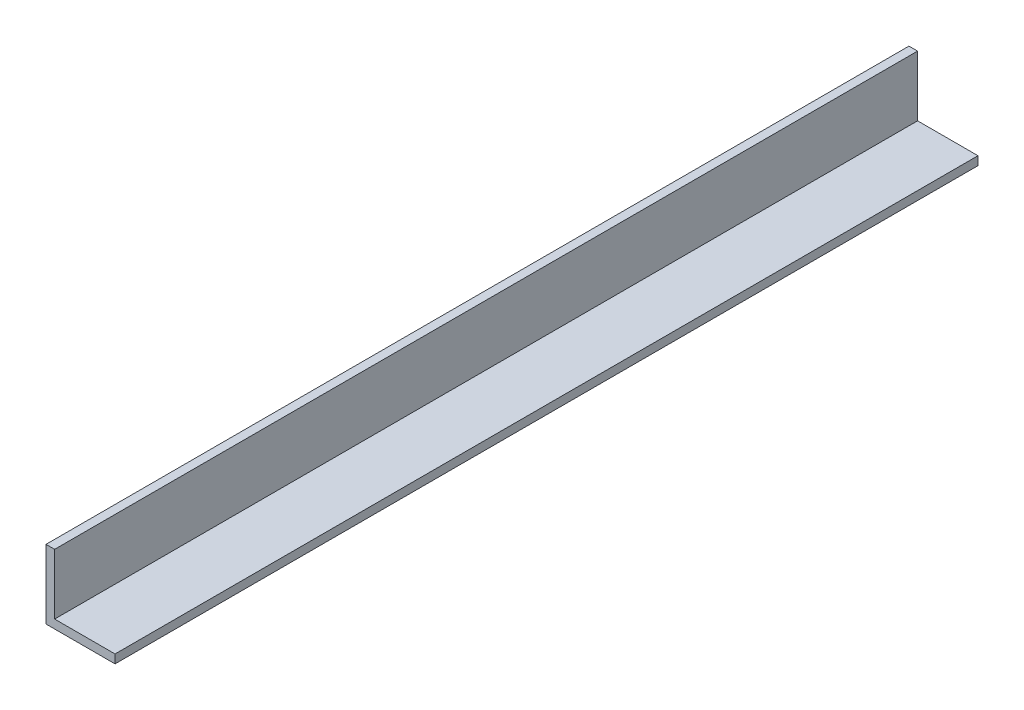
ISO-10303-21;
HEADER;
FILE_DESCRIPTION(('STEP AP214'),'2;1');
FILE_NAME('part.step','',(''),(''),'','','');
FILE_SCHEMA(('AUTOMOTIVE_DESIGN { 1 0 10303 214 1 1 1 1 }'));
ENDSEC;
DATA;
#1=APPLICATION_CONTEXT('core data for automotive mechanical design processes');
#2=APPLICATION_PROTOCOL_DEFINITION('international standard','automotive_design',2000,#1);
#3=PRODUCT_CONTEXT('',#1,'mechanical');
#4=PRODUCT('Part','Part','',(#3));
#5=PRODUCT_RELATED_PRODUCT_CATEGORY('part','',(#4));
#6=PRODUCT_DEFINITION_FORMATION('','',#4);
#7=PRODUCT_DEFINITION_CONTEXT('part definition',#1,'design');
#8=PRODUCT_DEFINITION('design','',#6,#7);
#9=PRODUCT_DEFINITION_SHAPE('','',#8);
#10=(LENGTH_UNIT() NAMED_UNIT(*) SI_UNIT(.MILLI.,.METRE.));
#11=(NAMED_UNIT(*) PLANE_ANGLE_UNIT() SI_UNIT($,.RADIAN.));
#12=(NAMED_UNIT(*) SI_UNIT($,.STERADIAN.) SOLID_ANGLE_UNIT());
#13=UNCERTAINTY_MEASURE_WITH_UNIT(LENGTH_MEASURE(1.E-05),#10,'distance_accuracy_value','');
#14=(GEOMETRIC_REPRESENTATION_CONTEXT(3) GLOBAL_UNCERTAINTY_ASSIGNED_CONTEXT((#13)) GLOBAL_UNIT_ASSIGNED_CONTEXT((#10,
#11,#12)) REPRESENTATION_CONTEXT('',''));
#15=CARTESIAN_POINT('',(0.,0.,0.));
#16=DIRECTION('',(0.,0.,1.));
#17=DIRECTION('',(1.,0.,0.));
#18=AXIS2_PLACEMENT_3D('',#15,#16,#17);
#19=CARTESIAN_POINT('',(0.,0.,317.5));
#20=DIRECTION('',(1.,0.,0.));
#21=DIRECTION('',(0.,0.,-1.));
#22=AXIS2_PLACEMENT_3D('',#19,#20,#21);
#23=PLANE('',#22);
#24=DIRECTION('',(0.,-1.,0.));
#25=VECTOR('',#24,1.);
#26=CARTESIAN_POINT('',(0.,0.,0.));
#27=LINE('',#26,#25);
#28=CARTESIAN_POINT('',(0.,25.4,0.));
#29=VERTEX_POINT('',#28);
#30=CARTESIAN_POINT('',(0.,0.,0.));
#31=VERTEX_POINT('',#30);
#32=EDGE_CURVE('E119',#29,#31,#27,.T.);
#33=ORIENTED_EDGE('',*,*,#32,.T.);
#34=DIRECTION('',(0.,0.,-1.));
#35=VECTOR('',#34,1.);
#36=CARTESIAN_POINT('',(0.,0.,317.5));
#37=LINE('',#36,#35);
#38=CARTESIAN_POINT('',(0.,0.,317.5));
#39=VERTEX_POINT('',#38);
#40=EDGE_CURVE('E11',#39,#31,#37,.T.);
#41=ORIENTED_EDGE('',*,*,#40,.F.);
#42=DIRECTION('',(0.,-1.,0.));
#43=VECTOR('',#42,1.);
#44=CARTESIAN_POINT('',(0.,0.,317.5));
#45=LINE('',#44,#43);
#46=CARTESIAN_POINT('',(0.,25.4,317.5));
#47=VERTEX_POINT('',#46);
#48=EDGE_CURVE('E129',#47,#39,#45,.T.);
#49=ORIENTED_EDGE('',*,*,#48,.F.);
#50=DIRECTION('',(0.,0.,-1.));
#51=VECTOR('',#50,1.);
#52=CARTESIAN_POINT('',(0.,25.4,317.5));
#53=LINE('',#52,#51);
#54=EDGE_CURVE('E115',#47,#29,#53,.T.);
#55=ORIENTED_EDGE('',*,*,#54,.T.);
#56=EDGE_LOOP('',(#33,#41,#49,#55));
#57=FACE_BOUND('',#56,.T.);
#58=ADVANCED_FACE('F35',(#57),#23,.F.);
#59=CARTESIAN_POINT('',(0.,0.,317.5));
#60=DIRECTION('',(0.,1.,0.));
#61=DIRECTION('',(0.,0.,1.));
#62=AXIS2_PLACEMENT_3D('',#59,#60,#61);
#63=PLANE('',#62);
#64=DIRECTION('',(1.,0.,0.));
#65=VECTOR('',#64,1.);
#66=CARTESIAN_POINT('',(0.,0.,0.));
#67=LINE('',#66,#65);
#68=CARTESIAN_POINT('',(25.4,0.,0.));
#69=VERTEX_POINT('',#68);
#70=EDGE_CURVE('E122',#31,#69,#67,.T.);
#71=ORIENTED_EDGE('',*,*,#70,.T.);
#72=DIRECTION('',(0.,0.,-1.));
#73=VECTOR('',#72,1.);
#74=CARTESIAN_POINT('',(25.4,0.,317.5));
#75=LINE('',#74,#73);
#76=CARTESIAN_POINT('',(25.4,0.,317.5));
#77=VERTEX_POINT('',#76);
#78=EDGE_CURVE('E43',#77,#69,#75,.T.);
#79=ORIENTED_EDGE('',*,*,#78,.F.);
#80=DIRECTION('',(1.,0.,0.));
#81=VECTOR('',#80,1.);
#82=CARTESIAN_POINT('',(0.,0.,317.5));
#83=LINE('',#82,#81);
#84=EDGE_CURVE('E88',#39,#77,#83,.T.);
#85=ORIENTED_EDGE('',*,*,#84,.F.);
#86=ORIENTED_EDGE('',*,*,#40,.T.);
#87=EDGE_LOOP('',(#71,#79,#85,#86));
#88=FACE_BOUND('',#87,.T.);
#89=ADVANCED_FACE('F153',(#88),#63,.F.);
#90=CARTESIAN_POINT('',(25.4,0.,317.5));
#91=DIRECTION('',(-1.,0.,0.));
#92=DIRECTION('',(0.,0.,1.));
#93=AXIS2_PLACEMENT_3D('',#90,#91,#92);
#94=PLANE('',#93);
#95=DIRECTION('',(0.,1.,0.));
#96=VECTOR('',#95,1.);
#97=CARTESIAN_POINT('',(25.4,0.,0.));
#98=LINE('',#97,#96);
#99=CARTESIAN_POINT('',(25.4,3.175,0.));
#100=VERTEX_POINT('',#99);
#101=EDGE_CURVE('E124',#69,#100,#98,.T.);
#102=ORIENTED_EDGE('',*,*,#101,.T.);
#103=DIRECTION('',(0.,0.,-1.));
#104=VECTOR('',#103,1.);
#105=CARTESIAN_POINT('',(25.4,3.175,317.5));
#106=LINE('',#105,#104);
#107=CARTESIAN_POINT('',(25.4,3.175,317.5));
#108=VERTEX_POINT('',#107);
#109=EDGE_CURVE('E110',#108,#100,#106,.T.);
#110=ORIENTED_EDGE('',*,*,#109,.F.);
#111=DIRECTION('',(0.,1.,0.));
#112=VECTOR('',#111,1.);
#113=CARTESIAN_POINT('',(25.4,0.,317.5));
#114=LINE('',#113,#112);
#115=EDGE_CURVE('E101',#77,#108,#114,.T.);
#116=ORIENTED_EDGE('',*,*,#115,.F.);
#117=ORIENTED_EDGE('',*,*,#78,.T.);
#118=EDGE_LOOP('',(#102,#110,#116,#117));
#119=FACE_BOUND('',#118,.T.);
#120=ADVANCED_FACE('F135',(#119),#94,.F.);
#121=CARTESIAN_POINT('',(25.4,3.175,317.5));
#122=DIRECTION('',(0.,-1.,0.));
#123=DIRECTION('',(1.,0.,0.));
#124=AXIS2_PLACEMENT_3D('',#121,#122,#123);
#125=PLANE('',#124);
#126=DIRECTION('',(-1.,0.,0.));
#127=VECTOR('',#126,1.);
#128=CARTESIAN_POINT('',(25.4,3.175,0.));
#129=LINE('',#128,#127);
#130=CARTESIAN_POINT('',(3.175,3.175,0.));
#131=VERTEX_POINT('',#130);
#132=EDGE_CURVE('E109',#100,#131,#129,.T.);
#133=ORIENTED_EDGE('',*,*,#132,.T.);
#134=DIRECTION('',(0.,0.,-1.));
#135=VECTOR('',#134,1.);
#136=CARTESIAN_POINT('',(3.175,3.175,317.5));
#137=LINE('',#136,#135);
#138=CARTESIAN_POINT('',(3.175,3.175,317.5));
#139=VERTEX_POINT('',#138);
#140=EDGE_CURVE('E106',#139,#131,#137,.T.);
#141=ORIENTED_EDGE('',*,*,#140,.F.);
#142=DIRECTION('',(-1.,0.,0.));
#143=VECTOR('',#142,1.);
#144=CARTESIAN_POINT('',(25.4,3.175,317.5));
#145=LINE('',#144,#143);
#146=EDGE_CURVE('E95',#108,#139,#145,.T.);
#147=ORIENTED_EDGE('',*,*,#146,.F.);
#148=ORIENTED_EDGE('',*,*,#109,.T.);
#149=EDGE_LOOP('',(#133,#141,#147,#148));
#150=FACE_BOUND('',#149,.T.);
#151=ADVANCED_FACE('F107',(#150),#125,.F.);
#152=CARTESIAN_POINT('',(3.175,25.4,317.5));
#153=DIRECTION('',(-1.,0.,0.));
#154=DIRECTION('',(0.,-1.,0.));
#155=AXIS2_PLACEMENT_3D('',#152,#153,#154);
#156=PLANE('',#155);
#157=DIRECTION('',(0.,1.,0.));
#158=VECTOR('',#157,1.);
#159=CARTESIAN_POINT('',(3.175,25.4,0.));
#160=LINE('',#159,#158);
#161=CARTESIAN_POINT('',(3.175,25.4,0.));
#162=VERTEX_POINT('',#161);
#163=EDGE_CURVE('E74',#131,#162,#160,.T.);
#164=ORIENTED_EDGE('',*,*,#163,.T.);
#165=DIRECTION('',(0.,0.,-1.));
#166=VECTOR('',#165,1.);
#167=CARTESIAN_POINT('',(3.175,25.4,317.5));
#168=LINE('',#167,#166);
#169=CARTESIAN_POINT('',(3.175,25.4,317.5));
#170=VERTEX_POINT('',#169);
#171=EDGE_CURVE('E111',#170,#162,#168,.T.);
#172=ORIENTED_EDGE('',*,*,#171,.F.);
#173=DIRECTION('',(0.,1.,0.));
#174=VECTOR('',#173,1.);
#175=CARTESIAN_POINT('',(3.175,25.4,317.5));
#176=LINE('',#175,#174);
#177=EDGE_CURVE('E99',#139,#170,#176,.T.);
#178=ORIENTED_EDGE('',*,*,#177,.F.);
#179=ORIENTED_EDGE('',*,*,#140,.T.);
#180=EDGE_LOOP('',(#164,#172,#178,#179));
#181=FACE_BOUND('',#180,.T.);
#182=ADVANCED_FACE('F113',(#181),#156,.F.);
#183=CARTESIAN_POINT('',(0.,25.4,317.5));
#184=DIRECTION('',(0.,-1.,0.));
#185=DIRECTION('',(0.,0.,-1.));
#186=AXIS2_PLACEMENT_3D('',#183,#184,#185);
#187=PLANE('',#186);
#188=DIRECTION('',(-1.,0.,0.));
#189=VECTOR('',#188,1.);
#190=CARTESIAN_POINT('',(0.,25.4,0.));
#191=LINE('',#190,#189);
#192=EDGE_CURVE('E80',#162,#29,#191,.T.);
#193=ORIENTED_EDGE('',*,*,#192,.T.);
#194=ORIENTED_EDGE('',*,*,#54,.F.);
#195=DIRECTION('',(-1.,0.,0.));
#196=VECTOR('',#195,1.);
#197=CARTESIAN_POINT('',(0.,25.4,317.5));
#198=LINE('',#197,#196);
#199=EDGE_CURVE('E51',#170,#47,#198,.T.);
#200=ORIENTED_EDGE('',*,*,#199,.F.);
#201=ORIENTED_EDGE('',*,*,#171,.T.);
#202=EDGE_LOOP('',(#193,#194,#200,#201));
#203=FACE_BOUND('',#202,.T.);
#204=ADVANCED_FACE('F142',(#203),#187,.F.);
#205=CARTESIAN_POINT('',(0.,0.,317.5));
#206=DIRECTION('',(0.,0.,-1.));
#207=DIRECTION('',(-1.,0.,0.));
#208=AXIS2_PLACEMENT_3D('',#205,#206,#207);
#209=PLANE('',#208);
#210=ORIENTED_EDGE('',*,*,#48,.T.);
#211=ORIENTED_EDGE('',*,*,#84,.T.);
#212=ORIENTED_EDGE('',*,*,#115,.T.);
#213=ORIENTED_EDGE('',*,*,#146,.T.);
#214=ORIENTED_EDGE('',*,*,#177,.T.);
#215=ORIENTED_EDGE('',*,*,#199,.T.);
#216=EDGE_LOOP('',(#210,#211,#212,#213,#214,#215));
#217=FACE_BOUND('',#216,.T.);
#218=ADVANCED_FACE('F97',(#217),#209,.F.);
#219=CARTESIAN_POINT('',(0.,0.,0.));
#220=DIRECTION('',(0.,0.,-1.));
#221=DIRECTION('',(-1.,0.,0.));
#222=AXIS2_PLACEMENT_3D('',#219,#220,#221);
#223=PLANE('',#222);
#224=ORIENTED_EDGE('',*,*,#32,.F.);
#225=ORIENTED_EDGE('',*,*,#192,.F.);
#226=ORIENTED_EDGE('',*,*,#163,.F.);
#227=ORIENTED_EDGE('',*,*,#132,.F.);
#228=ORIENTED_EDGE('',*,*,#101,.F.);
#229=ORIENTED_EDGE('',*,*,#70,.F.);
#230=EDGE_LOOP('',(#224,#225,#226,#227,#228,#229));
#231=FACE_BOUND('',#230,.T.);
#232=ADVANCED_FACE('F138',(#231),#223,.T.);
#233=CLOSED_SHELL('',(#58,#89,#120,#151,#182,#204,#218,#232));
#234=MANIFOLD_SOLID_BREP('B2',#233);
#235=ADVANCED_BREP_SHAPE_REPRESENTATION('',(#18,#234),#14);
#236=SHAPE_DEFINITION_REPRESENTATION(#9,#235);
ENDSEC;
END-ISO-10303-21;
